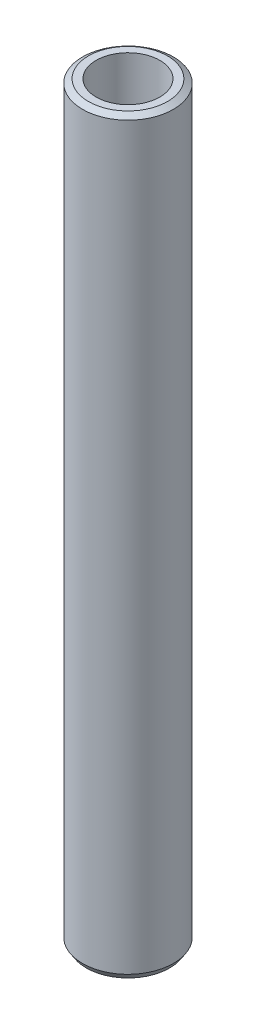
ISO-10303-21;
HEADER;
FILE_DESCRIPTION(('STEP AP214'),'2;1');
FILE_NAME('part.step','',(''),(''),'','','');
FILE_SCHEMA(('AUTOMOTIVE_DESIGN { 1 0 10303 214 1 1 1 1 }'));
ENDSEC;
DATA;
#1=APPLICATION_CONTEXT('core data for automotive mechanical design processes');
#2=APPLICATION_PROTOCOL_DEFINITION('international standard','automotive_design',2000,#1);
#3=PRODUCT_CONTEXT('',#1,'mechanical');
#4=PRODUCT('Part','Part','',(#3));
#5=PRODUCT_RELATED_PRODUCT_CATEGORY('part','',(#4));
#6=PRODUCT_DEFINITION_FORMATION('','',#4);
#7=PRODUCT_DEFINITION_CONTEXT('part definition',#1,'design');
#8=PRODUCT_DEFINITION('design','',#6,#7);
#9=PRODUCT_DEFINITION_SHAPE('','',#8);
#10=(LENGTH_UNIT() NAMED_UNIT(*) SI_UNIT(.MILLI.,.METRE.));
#11=(NAMED_UNIT(*) PLANE_ANGLE_UNIT() SI_UNIT($,.RADIAN.));
#12=(NAMED_UNIT(*) SI_UNIT($,.STERADIAN.) SOLID_ANGLE_UNIT());
#13=UNCERTAINTY_MEASURE_WITH_UNIT(LENGTH_MEASURE(1.E-05),#10,'distance_accuracy_value','');
#14=(GEOMETRIC_REPRESENTATION_CONTEXT(3) GLOBAL_UNCERTAINTY_ASSIGNED_CONTEXT((#13)) GLOBAL_UNIT_ASSIGNED_CONTEXT((#10,
#11,#12)) REPRESENTATION_CONTEXT('',''));
#15=CARTESIAN_POINT('',(0.,0.,0.));
#16=DIRECTION('',(0.,0.,1.));
#17=DIRECTION('',(1.,0.,0.));
#18=AXIS2_PLACEMENT_3D('',#15,#16,#17);
#19=CARTESIAN_POINT('',(0.,494.561998421311,0.));
#20=DIRECTION('',(0.,-1.,0.));
#21=DIRECTION('',(0.,0.,-1.));
#22=AXIS2_PLACEMENT_3D('',#19,#20,#21);
#23=CYLINDRICAL_SURFACE('',#22,30.);
#24=CARTESIAN_POINT('',(0.,492.042717478701,0.));
#25=DIRECTION('',(0.,1.,0.));
#26=DIRECTION('',(0.,0.,1.));
#27=AXIS2_PLACEMENT_3D('',#24,#25,#26);
#28=CIRCLE('',#27,30.);
#29=CARTESIAN_POINT('',(0.,492.042717478701,30.));
#30=VERTEX_POINT('',#29);
#31=EDGE_CURVE('E50',#30,#30,#28,.F.);
#32=ORIENTED_EDGE('',*,*,#31,.T.);
#33=EDGE_LOOP('',(#32));
#34=FACE_BOUND('',#33,.T.);
#35=CARTESIAN_POINT('',(0.,3.89341972740559,0.));
#36=DIRECTION('',(0.,1.,0.));
#37=DIRECTION('',(0.,0.,1.));
#38=AXIS2_PLACEMENT_3D('',#35,#36,#37);
#39=CIRCLE('',#38,30.);
#40=CARTESIAN_POINT('',(0.,3.89341972740559,30.));
#41=VERTEX_POINT('',#40);
#42=EDGE_CURVE('E51',#41,#41,#39,.T.);
#43=ORIENTED_EDGE('',*,*,#42,.T.);
#44=EDGE_LOOP('',(#43));
#45=FACE_BOUND('',#44,.T.);
#46=ADVANCED_FACE('F39',(#34,#45),#23,.T.);
#47=CARTESIAN_POINT('',(0.,494.561998421311,0.));
#48=DIRECTION('',(0.,1.,0.));
#49=DIRECTION('',(0.,0.,1.));
#50=AXIS2_PLACEMENT_3D('',#47,#48,#49);
#51=PLANE('',#50);
#52=CARTESIAN_POINT('',(0.,494.561998421311,0.));
#53=DIRECTION('',(0.,1.,0.));
#54=DIRECTION('',(0.,0.,1.));
#55=AXIS2_PLACEMENT_3D('',#52,#53,#54);
#56=CIRCLE('',#55,26.1065802725943);
#57=CARTESIAN_POINT('',(0.,494.561998421311,26.1065802725943));
#58=VERTEX_POINT('',#57);
#59=EDGE_CURVE('E54',#58,#58,#56,.T.);
#60=ORIENTED_EDGE('',*,*,#59,.T.);
#61=EDGE_LOOP('',(#60));
#62=FACE_BOUND('',#61,.T.);
#63=CARTESIAN_POINT('',(0.,494.561998421311,0.));
#64=DIRECTION('',(0.,1.,0.));
#65=DIRECTION('',(0.,0.,1.));
#66=AXIS2_PLACEMENT_3D('',#63,#64,#65);
#67=CIRCLE('',#66,21.0183104279771);
#68=CARTESIAN_POINT('',(0.,494.561998421311,21.0183104279771));
#69=VERTEX_POINT('',#68);
#70=EDGE_CURVE('E58',#69,#69,#67,.T.);
#71=ORIENTED_EDGE('',*,*,#70,.F.);
#72=EDGE_LOOP('',(#71));
#73=FACE_BOUND('',#72,.T.);
#74=ADVANCED_FACE('F69',(#62,#73),#51,.T.);
#75=CARTESIAN_POINT('',(0.,0.,0.));
#76=DIRECTION('',(0.,1.,0.));
#77=DIRECTION('',(0.,0.,1.));
#78=AXIS2_PLACEMENT_3D('',#75,#76,#77);
#79=PLANE('',#78);
#80=CARTESIAN_POINT('',(0.,0.,0.));
#81=DIRECTION('',(0.,1.,0.));
#82=DIRECTION('',(0.,0.,1.));
#83=AXIS2_PLACEMENT_3D('',#80,#81,#82);
#84=CIRCLE('',#83,27.4807190573902);
#85=CARTESIAN_POINT('',(0.,0.,27.4807190573902));
#86=VERTEX_POINT('',#85);
#87=EDGE_CURVE('E10',#86,#86,#84,.F.);
#88=ORIENTED_EDGE('',*,*,#87,.T.);
#89=EDGE_LOOP('',(#88));
#90=FACE_BOUND('',#89,.T.);
#91=CARTESIAN_POINT('',(0.,0.,0.));
#92=DIRECTION('',(0.,1.,0.));
#93=DIRECTION('',(0.,0.,1.));
#94=AXIS2_PLACEMENT_3D('',#91,#92,#93);
#95=CIRCLE('',#94,21.0183104279771);
#96=CARTESIAN_POINT('',(0.,0.,21.0183104279771));
#97=VERTEX_POINT('',#96);
#98=EDGE_CURVE('E63',#97,#97,#95,.T.);
#99=ORIENTED_EDGE('',*,*,#98,.T.);
#100=EDGE_LOOP('',(#99));
#101=FACE_BOUND('',#100,.T.);
#102=ADVANCED_FACE('F75',(#90,#101),#79,.F.);
#103=CARTESIAN_POINT('',(0.,494.561998421311,0.));
#104=DIRECTION('',(0.,-1.,0.));
#105=DIRECTION('',(0.,0.,-1.));
#106=AXIS2_PLACEMENT_3D('',#103,#104,#105);
#107=CYLINDRICAL_SURFACE('',#106,21.0183104279771);
#108=ORIENTED_EDGE('',*,*,#70,.T.);
#109=EDGE_LOOP('',(#108));
#110=FACE_BOUND('',#109,.T.);
#111=ORIENTED_EDGE('',*,*,#98,.F.);
#112=EDGE_LOOP('',(#111));
#113=FACE_BOUND('',#112,.T.);
#114=ADVANCED_FACE('F70',(#110,#113),#107,.F.);
#115=CARTESIAN_POINT('',(0.,494.561998421311,0.));
#116=DIRECTION('',(0.,-1.,0.));
#117=DIRECTION('',(0.,0.,-1.));
#118=AXIS2_PLACEMENT_3D('',#115,#116,#117);
#119=CONICAL_SURFACE('',#118,26.1065802725943,0.99648980308961);
#120=ORIENTED_EDGE('',*,*,#31,.F.);
#121=EDGE_LOOP('',(#120));
#122=FACE_BOUND('',#121,.T.);
#123=ORIENTED_EDGE('',*,*,#59,.F.);
#124=EDGE_LOOP('',(#123));
#125=FACE_BOUND('',#124,.T.);
#126=ADVANCED_FACE('F81',(#122,#125),#119,.T.);
#127=CARTESIAN_POINT('',(0.,3.89341972740559,0.));
#128=DIRECTION('',(0.,1.,0.));
#129=DIRECTION('',(0.,0.,1.));
#130=AXIS2_PLACEMENT_3D('',#127,#128,#129);
#131=CONICAL_SURFACE('',#130,30.,0.574306523705288);
#132=ORIENTED_EDGE('',*,*,#87,.F.);
#133=EDGE_LOOP('',(#132));
#134=FACE_BOUND('',#133,.T.);
#135=ORIENTED_EDGE('',*,*,#42,.F.);
#136=EDGE_LOOP('',(#135));
#137=FACE_BOUND('',#136,.T.);
#138=ADVANCED_FACE('F45',(#134,#137),#131,.T.);
#139=CLOSED_SHELL('',(#46,#74,#102,#114,#126,#138));
#140=MANIFOLD_SOLID_BREP('B2',#139);
#141=ADVANCED_BREP_SHAPE_REPRESENTATION('',(#18,#140),#14);
#142=SHAPE_DEFINITION_REPRESENTATION(#9,#141);
ENDSEC;
END-ISO-10303-21;
